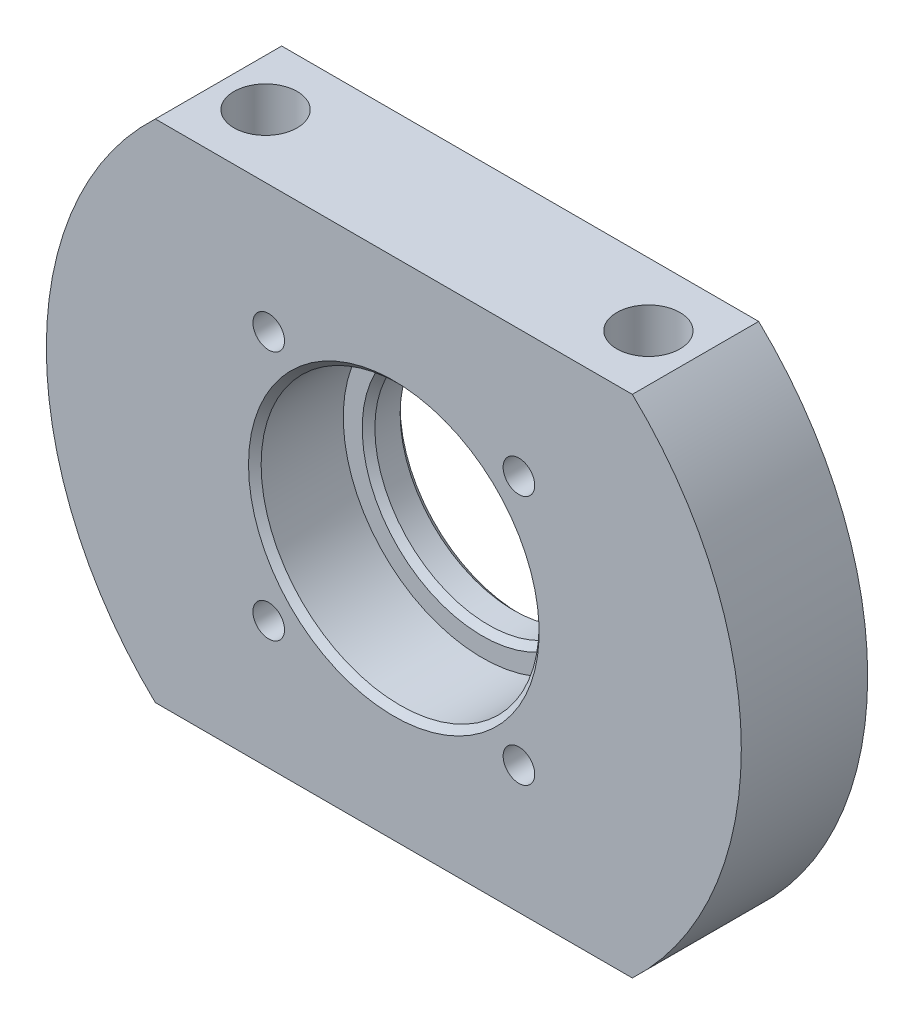
ISO-10303-21;
HEADER;
FILE_DESCRIPTION(('STEP AP214'),'2;1');
FILE_NAME('part.step','',(''),(''),'','','');
FILE_SCHEMA(('AUTOMOTIVE_DESIGN { 1 0 10303 214 1 1 1 1 }'));
ENDSEC;
DATA;
#1=APPLICATION_CONTEXT('core data for automotive mechanical design processes');
#2=APPLICATION_PROTOCOL_DEFINITION('international standard','automotive_design',2000,#1);
#3=PRODUCT_CONTEXT('',#1,'mechanical');
#4=PRODUCT('Part','Part','',(#3));
#5=PRODUCT_RELATED_PRODUCT_CATEGORY('part','',(#4));
#6=PRODUCT_DEFINITION_FORMATION('','',#4);
#7=PRODUCT_DEFINITION_CONTEXT('part definition',#1,'design');
#8=PRODUCT_DEFINITION('design','',#6,#7);
#9=PRODUCT_DEFINITION_SHAPE('','',#8);
#10=(LENGTH_UNIT() NAMED_UNIT(*) SI_UNIT(.MILLI.,.METRE.));
#11=(NAMED_UNIT(*) PLANE_ANGLE_UNIT() SI_UNIT($,.RADIAN.));
#12=(NAMED_UNIT(*) SI_UNIT($,.STERADIAN.) SOLID_ANGLE_UNIT());
#13=UNCERTAINTY_MEASURE_WITH_UNIT(LENGTH_MEASURE(1.E-05),#10,'distance_accuracy_value','');
#14=(GEOMETRIC_REPRESENTATION_CONTEXT(3) GLOBAL_UNCERTAINTY_ASSIGNED_CONTEXT((#13)) GLOBAL_UNIT_ASSIGNED_CONTEXT((#10,
#11,#12)) REPRESENTATION_CONTEXT('',''));
#15=CARTESIAN_POINT('',(0.,0.,0.));
#16=DIRECTION('',(0.,0.,1.));
#17=DIRECTION('',(1.,0.,0.));
#18=AXIS2_PLACEMENT_3D('',#15,#16,#17);
#19=CARTESIAN_POINT('',(18.8745860881769,20.,10.));
#20=DIRECTION('',(0.,0.,-1.));
#21=DIRECTION('',(-1.,0.,0.));
#22=AXIS2_PLACEMENT_3D('',#19,#20,#21);
#23=PLANE('',#22);
#24=CARTESIAN_POINT('',(8.97509115156518,29.8994949366116,10.));
#25=DIRECTION('',(0.,0.,1.));
#26=DIRECTION('',(1.,0.,0.));
#27=AXIS2_PLACEMENT_3D('',#24,#25,#26);
#28=CIRCLE('',#27,1.24999999999999);
#29=CARTESIAN_POINT('',(10.2250911515652,29.8994949366116,10.));
#30=VERTEX_POINT('',#29);
#31=EDGE_CURVE('E219',#30,#30,#28,.T.);
#32=ORIENTED_EDGE('',*,*,#31,.F.);
#33=EDGE_LOOP('',(#32));
#34=FACE_BOUND('',#33,.T.);
#35=CARTESIAN_POINT('',(28.7740810247886,10.1005050633884,10.));
#36=DIRECTION('',(0.,0.,1.));
#37=DIRECTION('',(1.,0.,0.));
#38=AXIS2_PLACEMENT_3D('',#35,#36,#37);
#39=CIRCLE('',#38,1.24999999999999);
#40=CARTESIAN_POINT('',(30.0240810247885,10.1005050633884,10.));
#41=VERTEX_POINT('',#40);
#42=EDGE_CURVE('E231',#41,#41,#39,.T.);
#43=ORIENTED_EDGE('',*,*,#42,.F.);
#44=EDGE_LOOP('',(#43));
#45=FACE_BOUND('',#44,.T.);
#46=CARTESIAN_POINT('',(18.8745860881769,20.,10.));
#47=DIRECTION('',(0.,0.,-1.));
#48=DIRECTION('',(-1.,0.,0.));
#49=AXIS2_PLACEMENT_3D('',#46,#47,#48);
#50=CIRCLE('',#49,11.5);
#51=CARTESIAN_POINT('',(7.37458608817689,20.,10.));
#52=VERTEX_POINT('',#51);
#53=EDGE_CURVE('E111',#52,#52,#50,.T.);
#54=ORIENTED_EDGE('',*,*,#53,.T.);
#55=EDGE_LOOP('',(#54));
#56=FACE_BOUND('',#55,.T.);
#57=CARTESIAN_POINT('',(18.8745860881769,20.,10.));
#58=DIRECTION('',(0.,0.,1.));
#59=DIRECTION('',(-1.,0.,0.));
#60=AXIS2_PLACEMENT_3D('',#57,#58,#59);
#61=CIRCLE('',#60,27.5);
#62=CARTESIAN_POINT('',(0.,40.,10.));
#63=VERTEX_POINT('',#62);
#64=CARTESIAN_POINT('',(0.,0.,10.));
#65=VERTEX_POINT('',#64);
#66=EDGE_CURVE('E83',#63,#65,#61,.T.);
#67=ORIENTED_EDGE('',*,*,#66,.T.);
#68=DIRECTION('',(1.,0.,0.));
#69=VECTOR('',#68,1.);
#70=CARTESIAN_POINT('',(0.,0.,10.));
#71=LINE('',#70,#69);
#72=CARTESIAN_POINT('',(37.7491721763538,0.,10.));
#73=VERTEX_POINT('',#72);
#74=EDGE_CURVE('E78',#65,#73,#71,.T.);
#75=ORIENTED_EDGE('',*,*,#74,.T.);
#76=CARTESIAN_POINT('',(18.8745860881769,20.,10.));
#77=DIRECTION('',(0.,0.,1.));
#78=DIRECTION('',(1.,0.,0.));
#79=AXIS2_PLACEMENT_3D('',#76,#77,#78);
#80=CIRCLE('',#79,27.5);
#81=CARTESIAN_POINT('',(37.7491721763538,40.,10.));
#82=VERTEX_POINT('',#81);
#83=EDGE_CURVE('E81',#73,#82,#80,.T.);
#84=ORIENTED_EDGE('',*,*,#83,.T.);
#85=DIRECTION('',(-1.,0.,0.));
#86=VECTOR('',#85,1.);
#87=CARTESIAN_POINT('',(0.,40.,10.));
#88=LINE('',#87,#86);
#89=EDGE_CURVE('E47',#82,#63,#88,.T.);
#90=ORIENTED_EDGE('',*,*,#89,.T.);
#91=EDGE_LOOP('',(#67,#75,#84,#90));
#92=FACE_BOUND('',#91,.T.);
#93=CARTESIAN_POINT('',(8.97509115156526,10.1005050633883,10.));
#94=DIRECTION('',(0.,0.,1.));
#95=DIRECTION('',(1.,0.,0.));
#96=AXIS2_PLACEMENT_3D('',#93,#94,#95);
#97=CIRCLE('',#96,1.24999999999999);
#98=CARTESIAN_POINT('',(10.2250911515652,10.1005050633883,10.));
#99=VERTEX_POINT('',#98);
#100=EDGE_CURVE('E225',#99,#99,#97,.T.);
#101=ORIENTED_EDGE('',*,*,#100,.F.);
#102=EDGE_LOOP('',(#101));
#103=FACE_BOUND('',#102,.T.);
#104=CARTESIAN_POINT('',(28.7740810247885,29.8994949366117,10.));
#105=DIRECTION('',(0.,0.,1.));
#106=DIRECTION('',(1.,0.,0.));
#107=AXIS2_PLACEMENT_3D('',#104,#105,#106);
#108=CIRCLE('',#107,1.24999999999999);
#109=CARTESIAN_POINT('',(30.0240810247885,29.8994949366117,10.));
#110=VERTEX_POINT('',#109);
#111=EDGE_CURVE('E211',#110,#110,#108,.T.);
#112=ORIENTED_EDGE('',*,*,#111,.F.);
#113=EDGE_LOOP('',(#112));
#114=FACE_BOUND('',#113,.T.);
#115=ADVANCED_FACE('F30',(#34,#45,#56,#92,#103,#114),#23,.F.);
#116=CARTESIAN_POINT('',(18.8745860881769,20.,10.));
#117=DIRECTION('',(0.,0.,-1.));
#118=DIRECTION('',(-1.,0.,0.));
#119=AXIS2_PLACEMENT_3D('',#116,#117,#118);
#120=CYLINDRICAL_SURFACE('',#119,9.);
#121=CARTESIAN_POINT('',(18.8745860881769,20.,2.5));
#122=DIRECTION('',(0.,0.,1.));
#123=DIRECTION('',(1.,0.,0.));
#124=AXIS2_PLACEMENT_3D('',#121,#122,#123);
#125=CIRCLE('',#124,9.);
#126=CARTESIAN_POINT('',(27.8745860881769,20.,2.5));
#127=VERTEX_POINT('',#126);
#128=EDGE_CURVE('E117',#127,#127,#125,.T.);
#129=ORIENTED_EDGE('',*,*,#128,.T.);
#130=EDGE_LOOP('',(#129));
#131=FACE_BOUND('',#130,.T.);
#132=CARTESIAN_POINT('',(18.8745860881769,20.,0.499999999999994));
#133=DIRECTION('',(0.,0.,-1.));
#134=DIRECTION('',(-1.,0.,0.));
#135=AXIS2_PLACEMENT_3D('',#132,#133,#134);
#136=CIRCLE('',#135,9.);
#137=CARTESIAN_POINT('',(9.87458608817687,20.,0.499999999999994));
#138=VERTEX_POINT('',#137);
#139=EDGE_CURVE('E114',#138,#138,#136,.T.);
#140=ORIENTED_EDGE('',*,*,#139,.T.);
#141=EDGE_LOOP('',(#140));
#142=FACE_BOUND('',#141,.T.);
#143=ADVANCED_FACE('F131',(#131,#142),#120,.F.);
#144=CARTESIAN_POINT('',(18.8745860881769,20.,0.));
#145=DIRECTION('',(0.,0.,-1.));
#146=DIRECTION('',(-1.,0.,0.));
#147=AXIS2_PLACEMENT_3D('',#144,#145,#146);
#148=PLANE('',#147);
#149=CARTESIAN_POINT('',(28.7740810247885,29.8994949366117,0.));
#150=DIRECTION('',(0.,0.,-1.));
#151=DIRECTION('',(-1.,0.,0.));
#152=AXIS2_PLACEMENT_3D('',#149,#150,#151);
#153=CIRCLE('',#152,1.24999999999999);
#154=CARTESIAN_POINT('',(27.5240810247885,29.8994949366117,0.));
#155=VERTEX_POINT('',#154);
#156=EDGE_CURVE('E216',#155,#155,#153,.T.);
#157=ORIENTED_EDGE('',*,*,#156,.F.);
#158=EDGE_LOOP('',(#157));
#159=FACE_BOUND('',#158,.T.);
#160=CARTESIAN_POINT('',(8.97509115156518,29.8994949366116,0.));
#161=DIRECTION('',(0.,0.,-1.));
#162=DIRECTION('',(-1.,0.,0.));
#163=AXIS2_PLACEMENT_3D('',#160,#161,#162);
#164=CIRCLE('',#163,1.24999999999999);
#165=CARTESIAN_POINT('',(7.72509115156519,29.8994949366116,0.));
#166=VERTEX_POINT('',#165);
#167=EDGE_CURVE('E222',#166,#166,#164,.T.);
#168=ORIENTED_EDGE('',*,*,#167,.F.);
#169=EDGE_LOOP('',(#168));
#170=FACE_BOUND('',#169,.T.);
#171=CARTESIAN_POINT('',(8.97509115156526,10.1005050633883,0.));
#172=DIRECTION('',(0.,0.,-1.));
#173=DIRECTION('',(-1.,0.,0.));
#174=AXIS2_PLACEMENT_3D('',#171,#172,#173);
#175=CIRCLE('',#174,1.24999999999999);
#176=CARTESIAN_POINT('',(7.72509115156527,10.1005050633883,0.));
#177=VERTEX_POINT('',#176);
#178=EDGE_CURVE('E228',#177,#177,#175,.T.);
#179=ORIENTED_EDGE('',*,*,#178,.F.);
#180=EDGE_LOOP('',(#179));
#181=FACE_BOUND('',#180,.T.);
#182=CARTESIAN_POINT('',(28.7740810247886,10.1005050633884,0.));
#183=DIRECTION('',(0.,0.,-1.));
#184=DIRECTION('',(-1.,0.,0.));
#185=AXIS2_PLACEMENT_3D('',#182,#183,#184);
#186=CIRCLE('',#185,1.24999999999999);
#187=CARTESIAN_POINT('',(27.5240810247886,10.1005050633884,0.));
#188=VERTEX_POINT('',#187);
#189=EDGE_CURVE('E234',#188,#188,#186,.T.);
#190=ORIENTED_EDGE('',*,*,#189,.F.);
#191=EDGE_LOOP('',(#190));
#192=FACE_BOUND('',#191,.T.);
#193=CARTESIAN_POINT('',(18.8745860881769,20.,0.));
#194=DIRECTION('',(0.,0.,-1.));
#195=DIRECTION('',(-1.,0.,0.));
#196=AXIS2_PLACEMENT_3D('',#193,#194,#195);
#197=CIRCLE('',#196,9.49999999999998);
#198=CARTESIAN_POINT('',(9.37458608817689,20.,0.));
#199=VERTEX_POINT('',#198);
#200=EDGE_CURVE('E11',#199,#199,#197,.F.);
#201=ORIENTED_EDGE('',*,*,#200,.T.);
#202=EDGE_LOOP('',(#201));
#203=FACE_BOUND('',#202,.T.);
#204=CARTESIAN_POINT('',(18.8745860881769,20.,0.));
#205=DIRECTION('',(0.,0.,1.));
#206=DIRECTION('',(-1.,0.,0.));
#207=AXIS2_PLACEMENT_3D('',#204,#205,#206);
#208=CIRCLE('',#207,27.5);
#209=CARTESIAN_POINT('',(0.,40.,0.));
#210=VERTEX_POINT('',#209);
#211=CARTESIAN_POINT('',(0.,0.,0.));
#212=VERTEX_POINT('',#211);
#213=EDGE_CURVE('E98',#210,#212,#208,.T.);
#214=ORIENTED_EDGE('',*,*,#213,.F.);
#215=DIRECTION('',(-1.,0.,0.));
#216=VECTOR('',#215,1.);
#217=CARTESIAN_POINT('',(0.,40.,0.));
#218=LINE('',#217,#216);
#219=CARTESIAN_POINT('',(37.7491721763538,40.,0.));
#220=VERTEX_POINT('',#219);
#221=EDGE_CURVE('E70',#220,#210,#218,.T.);
#222=ORIENTED_EDGE('',*,*,#221,.F.);
#223=CARTESIAN_POINT('',(18.8745860881769,20.,0.));
#224=DIRECTION('',(0.,0.,1.));
#225=DIRECTION('',(1.,0.,0.));
#226=AXIS2_PLACEMENT_3D('',#223,#224,#225);
#227=CIRCLE('',#226,27.5);
#228=CARTESIAN_POINT('',(37.7491721763538,0.,0.));
#229=VERTEX_POINT('',#228);
#230=EDGE_CURVE('E64',#229,#220,#227,.T.);
#231=ORIENTED_EDGE('',*,*,#230,.F.);
#232=DIRECTION('',(1.,0.,0.));
#233=VECTOR('',#232,1.);
#234=CARTESIAN_POINT('',(0.,0.,0.));
#235=LINE('',#234,#233);
#236=EDGE_CURVE('E88',#212,#229,#235,.T.);
#237=ORIENTED_EDGE('',*,*,#236,.F.);
#238=EDGE_LOOP('',(#214,#222,#231,#237));
#239=FACE_BOUND('',#238,.T.);
#240=ADVANCED_FACE('F134',(#159,#170,#181,#192,#203,#239),#148,.T.);
#241=CARTESIAN_POINT('',(18.8745860881769,20.,10.));
#242=DIRECTION('',(0.,0.,-1.));
#243=DIRECTION('',(-1.,0.,0.));
#244=AXIS2_PLACEMENT_3D('',#241,#242,#243);
#245=CYLINDRICAL_SURFACE('',#244,27.5);
#246=ORIENTED_EDGE('',*,*,#213,.T.);
#247=DIRECTION('',(0.,0.,-1.));
#248=VECTOR('',#247,1.);
#249=CARTESIAN_POINT('',(0.,0.,10.));
#250=LINE('',#249,#248);
#251=EDGE_CURVE('E89',#65,#212,#250,.T.);
#252=ORIENTED_EDGE('',*,*,#251,.F.);
#253=ORIENTED_EDGE('',*,*,#66,.F.);
#254=DIRECTION('',(0.,0.,-1.));
#255=VECTOR('',#254,1.);
#256=CARTESIAN_POINT('',(0.,40.,10.));
#257=LINE('',#256,#255);
#258=EDGE_CURVE('E94',#63,#210,#257,.T.);
#259=ORIENTED_EDGE('',*,*,#258,.T.);
#260=EDGE_LOOP('',(#246,#252,#253,#259));
#261=FACE_BOUND('',#260,.T.);
#262=ADVANCED_FACE('F145',(#261),#245,.T.);
#263=CARTESIAN_POINT('',(0.,0.,10.));
#264=DIRECTION('',(0.,1.,0.));
#265=DIRECTION('',(-1.,0.,0.));
#266=AXIS2_PLACEMENT_3D('',#263,#264,#265);
#267=PLANE('',#266);
#268=CARTESIAN_POINT('',(34.0240810247886,0.,5.));
#269=DIRECTION('',(0.,1.,0.));
#270=DIRECTION('',(0.,0.,-1.));
#271=AXIS2_PLACEMENT_3D('',#268,#269,#270);
#272=CIRCLE('',#271,2.49999999999999);
#273=CARTESIAN_POINT('',(34.0240810247886,0.,2.50000000000001));
#274=VERTEX_POINT('',#273);
#275=EDGE_CURVE('E201',#274,#274,#272,.T.);
#276=ORIENTED_EDGE('',*,*,#275,.T.);
#277=EDGE_LOOP('',(#276));
#278=FACE_BOUND('',#277,.T.);
#279=CARTESIAN_POINT('',(3.72509115156519,0.,5.));
#280=DIRECTION('',(0.,1.,0.));
#281=DIRECTION('',(0.,0.,1.));
#282=AXIS2_PLACEMENT_3D('',#279,#280,#281);
#283=CIRCLE('',#282,2.5);
#284=CARTESIAN_POINT('',(3.72509115156519,0.,7.5));
#285=VERTEX_POINT('',#284);
#286=EDGE_CURVE('E208',#285,#285,#283,.T.);
#287=ORIENTED_EDGE('',*,*,#286,.T.);
#288=EDGE_LOOP('',(#287));
#289=FACE_BOUND('',#288,.T.);
#290=ORIENTED_EDGE('',*,*,#236,.T.);
#291=DIRECTION('',(0.,0.,-1.));
#292=VECTOR('',#291,1.);
#293=CARTESIAN_POINT('',(37.7491721763538,0.,10.));
#294=LINE('',#293,#292);
#295=EDGE_CURVE('E86',#73,#229,#294,.T.);
#296=ORIENTED_EDGE('',*,*,#295,.F.);
#297=ORIENTED_EDGE('',*,*,#74,.F.);
#298=ORIENTED_EDGE('',*,*,#251,.T.);
#299=EDGE_LOOP('',(#290,#296,#297,#298));
#300=FACE_BOUND('',#299,.T.);
#301=ADVANCED_FACE('F87',(#278,#289,#300),#267,.F.);
#302=CARTESIAN_POINT('',(18.8745860881769,20.,10.));
#303=DIRECTION('',(0.,0.,-1.));
#304=DIRECTION('',(-1.,0.,0.));
#305=AXIS2_PLACEMENT_3D('',#302,#303,#304);
#306=CYLINDRICAL_SURFACE('',#305,27.5);
#307=ORIENTED_EDGE('',*,*,#230,.T.);
#308=DIRECTION('',(0.,0.,-1.));
#309=VECTOR('',#308,1.);
#310=CARTESIAN_POINT('',(37.7491721763538,40.,10.));
#311=LINE('',#310,#309);
#312=EDGE_CURVE('E90',#82,#220,#311,.T.);
#313=ORIENTED_EDGE('',*,*,#312,.F.);
#314=ORIENTED_EDGE('',*,*,#83,.F.);
#315=ORIENTED_EDGE('',*,*,#295,.T.);
#316=EDGE_LOOP('',(#307,#313,#314,#315));
#317=FACE_BOUND('',#316,.T.);
#318=ADVANCED_FACE('F92',(#317),#306,.T.);
#319=CARTESIAN_POINT('',(0.,40.,10.));
#320=DIRECTION('',(0.,-1.,0.));
#321=DIRECTION('',(0.,0.,-1.));
#322=AXIS2_PLACEMENT_3D('',#319,#320,#321);
#323=PLANE('',#322);
#324=CARTESIAN_POINT('',(34.0240810247886,40.,5.));
#325=DIRECTION('',(0.,1.,0.));
#326=DIRECTION('',(0.,0.,-1.));
#327=AXIS2_PLACEMENT_3D('',#324,#325,#326);
#328=CIRCLE('',#327,2.49999999999999);
#329=CARTESIAN_POINT('',(34.0240810247886,40.,2.50000000000001));
#330=VERTEX_POINT('',#329);
#331=EDGE_CURVE('E203',#330,#330,#328,.T.);
#332=ORIENTED_EDGE('',*,*,#331,.F.);
#333=EDGE_LOOP('',(#332));
#334=FACE_BOUND('',#333,.T.);
#335=CARTESIAN_POINT('',(3.72509115156519,40.,5.));
#336=DIRECTION('',(0.,1.,0.));
#337=DIRECTION('',(0.,0.,1.));
#338=AXIS2_PLACEMENT_3D('',#335,#336,#337);
#339=CIRCLE('',#338,2.5);
#340=CARTESIAN_POINT('',(3.72509115156519,40.,7.5));
#341=VERTEX_POINT('',#340);
#342=EDGE_CURVE('E205',#341,#341,#339,.T.);
#343=ORIENTED_EDGE('',*,*,#342,.F.);
#344=EDGE_LOOP('',(#343));
#345=FACE_BOUND('',#344,.T.);
#346=ORIENTED_EDGE('',*,*,#221,.T.);
#347=ORIENTED_EDGE('',*,*,#258,.F.);
#348=ORIENTED_EDGE('',*,*,#89,.F.);
#349=ORIENTED_EDGE('',*,*,#312,.T.);
#350=EDGE_LOOP('',(#346,#347,#348,#349));
#351=FACE_BOUND('',#350,.T.);
#352=ADVANCED_FACE('F150',(#334,#345,#351),#323,.F.);
#353=CARTESIAN_POINT('',(18.8745860881769,20.,3.));
#354=DIRECTION('',(0.,0.,1.));
#355=DIRECTION('',(1.,0.,0.));
#356=AXIS2_PLACEMENT_3D('',#353,#354,#355);
#357=CYLINDRICAL_SURFACE('',#356,11.);
#358=CARTESIAN_POINT('',(18.8745860881769,20.,9.50000000000002));
#359=DIRECTION('',(0.,0.,-1.));
#360=DIRECTION('',(-1.,0.,0.));
#361=AXIS2_PLACEMENT_3D('',#358,#359,#360);
#362=CIRCLE('',#361,11.);
#363=CARTESIAN_POINT('',(7.87458608817687,20.,9.50000000000002));
#364=VERTEX_POINT('',#363);
#365=EDGE_CURVE('E108',#364,#364,#362,.F.);
#366=ORIENTED_EDGE('',*,*,#365,.T.);
#367=EDGE_LOOP('',(#366));
#368=FACE_BOUND('',#367,.T.);
#369=CARTESIAN_POINT('',(18.8745860881769,20.,3.));
#370=DIRECTION('',(0.,0.,1.));
#371=DIRECTION('',(1.,0.,0.));
#372=AXIS2_PLACEMENT_3D('',#369,#370,#371);
#373=CIRCLE('',#372,11.);
#374=CARTESIAN_POINT('',(29.8745860881769,20.,3.));
#375=VERTEX_POINT('',#374);
#376=EDGE_CURVE('E101',#375,#375,#373,.T.);
#377=ORIENTED_EDGE('',*,*,#376,.F.);
#378=EDGE_LOOP('',(#377));
#379=FACE_BOUND('',#378,.T.);
#380=ADVANCED_FACE('F152',(#368,#379),#357,.F.);
#381=CARTESIAN_POINT('',(18.8745860881769,20.,3.));
#382=DIRECTION('',(0.,0.,1.));
#383=DIRECTION('',(1.,0.,0.));
#384=AXIS2_PLACEMENT_3D('',#381,#382,#383);
#385=PLANE('',#384);
#386=CARTESIAN_POINT('',(18.8745860881769,20.,3.));
#387=DIRECTION('',(0.,0.,1.));
#388=DIRECTION('',(1.,0.,0.));
#389=AXIS2_PLACEMENT_3D('',#386,#387,#388);
#390=CIRCLE('',#389,9.5);
#391=CARTESIAN_POINT('',(28.3745860881769,20.,3.));
#392=VERTEX_POINT('',#391);
#393=EDGE_CURVE('E39',#392,#392,#390,.F.);
#394=ORIENTED_EDGE('',*,*,#393,.T.);
#395=EDGE_LOOP('',(#394));
#396=FACE_BOUND('',#395,.T.);
#397=ORIENTED_EDGE('',*,*,#376,.T.);
#398=EDGE_LOOP('',(#397));
#399=FACE_BOUND('',#398,.T.);
#400=ADVANCED_FACE('F122',(#396,#399),#385,.T.);
#401=CARTESIAN_POINT('',(18.8745860881769,20.,9.50000000000002));
#402=DIRECTION('',(0.,0.,1.));
#403=DIRECTION('',(1.,0.,0.));
#404=AXIS2_PLACEMENT_3D('',#401,#402,#403);
#405=CONICAL_SURFACE('',#404,11.,0.785398163397447);
#406=ORIENTED_EDGE('',*,*,#53,.F.);
#407=EDGE_LOOP('',(#406));
#408=FACE_BOUND('',#407,.T.);
#409=ORIENTED_EDGE('',*,*,#365,.F.);
#410=EDGE_LOOP('',(#409));
#411=FACE_BOUND('',#410,.T.);
#412=ADVANCED_FACE('F128',(#408,#411),#405,.F.);
#413=CARTESIAN_POINT('',(18.8745860881769,20.,2.5));
#414=DIRECTION('',(0.,0.,1.));
#415=DIRECTION('',(1.,0.,0.));
#416=AXIS2_PLACEMENT_3D('',#413,#414,#415);
#417=CONICAL_SURFACE('',#416,9.,0.785398163397454);
#418=ORIENTED_EDGE('',*,*,#393,.F.);
#419=EDGE_LOOP('',(#418));
#420=FACE_BOUND('',#419,.T.);
#421=ORIENTED_EDGE('',*,*,#128,.F.);
#422=EDGE_LOOP('',(#421));
#423=FACE_BOUND('',#422,.T.);
#424=ADVANCED_FACE('F125',(#420,#423),#417,.F.);
#425=CARTESIAN_POINT('',(18.8745860881769,20.,0.));
#426=DIRECTION('',(0.,0.,-1.));
#427=DIRECTION('',(-1.,0.,0.));
#428=AXIS2_PLACEMENT_3D('',#425,#426,#427);
#429=CONICAL_SURFACE('',#428,9.49999999999998,0.785398163397436);
#430=ORIENTED_EDGE('',*,*,#139,.F.);
#431=EDGE_LOOP('',(#430));
#432=FACE_BOUND('',#431,.T.);
#433=ORIENTED_EDGE('',*,*,#200,.F.);
#434=EDGE_LOOP('',(#433));
#435=FACE_BOUND('',#434,.T.);
#436=ADVANCED_FACE('F32',(#432,#435),#429,.F.);
#437=CARTESIAN_POINT('',(28.7740810247886,10.1005050633884,10.));
#438=DIRECTION('',(0.,0.,1.));
#439=DIRECTION('',(1.,0.,0.));
#440=AXIS2_PLACEMENT_3D('',#437,#438,#439);
#441=CYLINDRICAL_SURFACE('',#440,1.24999999999999);
#442=ORIENTED_EDGE('',*,*,#42,.T.);
#443=EDGE_LOOP('',(#442));
#444=FACE_BOUND('',#443,.T.);
#445=ORIENTED_EDGE('',*,*,#189,.T.);
#446=EDGE_LOOP('',(#445));
#447=FACE_BOUND('',#446,.T.);
#448=ADVANCED_FACE('F140',(#444,#447),#441,.F.);
#449=CARTESIAN_POINT('',(8.97509115156526,10.1005050633883,10.));
#450=DIRECTION('',(0.,0.,1.));
#451=DIRECTION('',(1.,0.,0.));
#452=AXIS2_PLACEMENT_3D('',#449,#450,#451);
#453=CYLINDRICAL_SURFACE('',#452,1.24999999999999);
#454=ORIENTED_EDGE('',*,*,#100,.T.);
#455=EDGE_LOOP('',(#454));
#456=FACE_BOUND('',#455,.T.);
#457=ORIENTED_EDGE('',*,*,#178,.T.);
#458=EDGE_LOOP('',(#457));
#459=FACE_BOUND('',#458,.T.);
#460=ADVANCED_FACE('F176',(#456,#459),#453,.F.);
#461=CARTESIAN_POINT('',(8.97509115156518,29.8994949366116,10.));
#462=DIRECTION('',(0.,0.,1.));
#463=DIRECTION('',(1.,0.,0.));
#464=AXIS2_PLACEMENT_3D('',#461,#462,#463);
#465=CYLINDRICAL_SURFACE('',#464,1.24999999999999);
#466=ORIENTED_EDGE('',*,*,#31,.T.);
#467=EDGE_LOOP('',(#466));
#468=FACE_BOUND('',#467,.T.);
#469=ORIENTED_EDGE('',*,*,#167,.T.);
#470=EDGE_LOOP('',(#469));
#471=FACE_BOUND('',#470,.T.);
#472=ADVANCED_FACE('F180',(#468,#471),#465,.F.);
#473=CARTESIAN_POINT('',(28.7740810247885,29.8994949366117,10.));
#474=DIRECTION('',(0.,0.,1.));
#475=DIRECTION('',(1.,0.,0.));
#476=AXIS2_PLACEMENT_3D('',#473,#474,#475);
#477=CYLINDRICAL_SURFACE('',#476,1.24999999999999);
#478=ORIENTED_EDGE('',*,*,#111,.T.);
#479=EDGE_LOOP('',(#478));
#480=FACE_BOUND('',#479,.T.);
#481=ORIENTED_EDGE('',*,*,#156,.T.);
#482=EDGE_LOOP('',(#481));
#483=FACE_BOUND('',#482,.T.);
#484=ADVANCED_FACE('F184',(#480,#483),#477,.F.);
#485=CARTESIAN_POINT('',(3.72509115156519,0.,5.));
#486=DIRECTION('',(0.,1.,0.));
#487=DIRECTION('',(0.,0.,1.));
#488=AXIS2_PLACEMENT_3D('',#485,#486,#487);
#489=CYLINDRICAL_SURFACE('',#488,2.5);
#490=ORIENTED_EDGE('',*,*,#286,.F.);
#491=EDGE_LOOP('',(#490));
#492=FACE_BOUND('',#491,.T.);
#493=ORIENTED_EDGE('',*,*,#342,.T.);
#494=EDGE_LOOP('',(#493));
#495=FACE_BOUND('',#494,.T.);
#496=ADVANCED_FACE('F188',(#492,#495),#489,.F.);
#497=CARTESIAN_POINT('',(34.0240810247886,0.,5.));
#498=DIRECTION('',(0.,1.,0.));
#499=DIRECTION('',(0.,0.,1.));
#500=AXIS2_PLACEMENT_3D('',#497,#498,#499);
#501=CYLINDRICAL_SURFACE('',#500,2.49999999999999);
#502=ORIENTED_EDGE('',*,*,#275,.F.);
#503=EDGE_LOOP('',(#502));
#504=FACE_BOUND('',#503,.T.);
#505=ORIENTED_EDGE('',*,*,#331,.T.);
#506=EDGE_LOOP('',(#505));
#507=FACE_BOUND('',#506,.T.);
#508=ADVANCED_FACE('F192',(#504,#507),#501,.F.);
#509=CLOSED_SHELL('',(#115,#143,#240,#262,#301,#318,#352,#380,#400,#412,#424,#436,#448,#460,
#472,#484,#496,#508));
#510=MANIFOLD_SOLID_BREP('B2',#509);
#511=ADVANCED_BREP_SHAPE_REPRESENTATION('',(#18,#510),#14);
#512=SHAPE_DEFINITION_REPRESENTATION(#9,#511);
ENDSEC;
END-ISO-10303-21;
